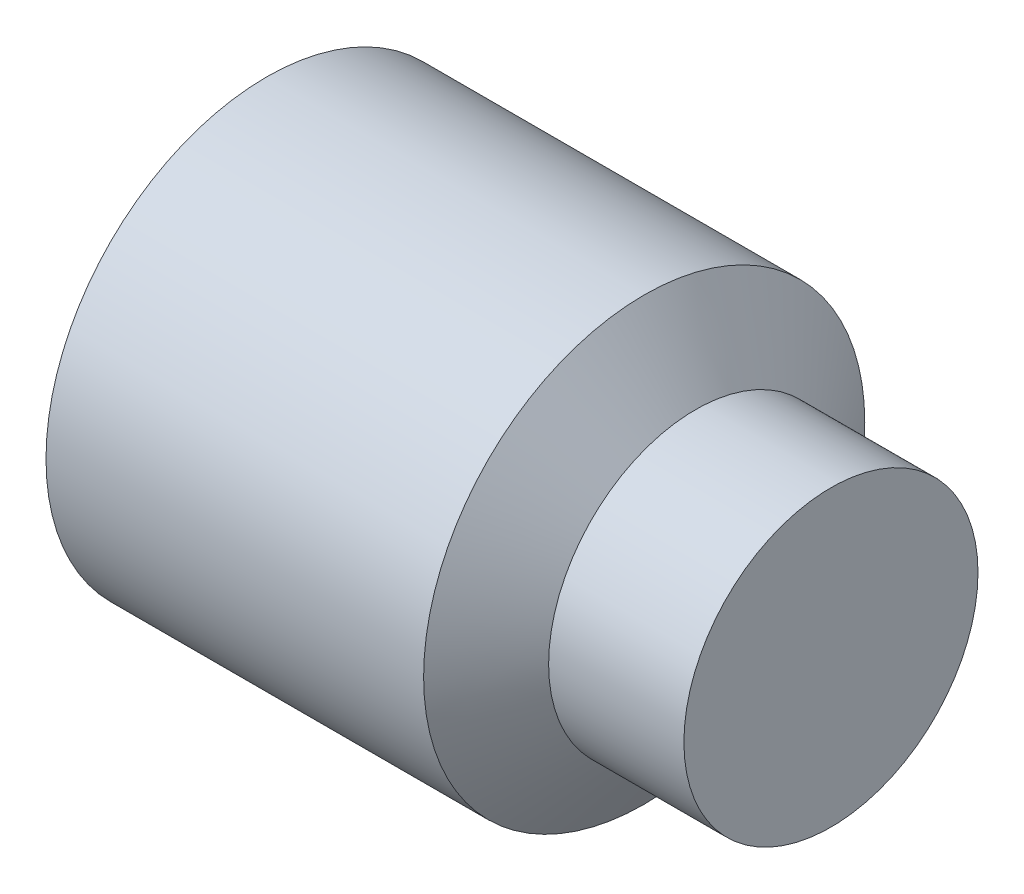
ISO-10303-21;
HEADER;
FILE_DESCRIPTION(('STEP AP214'),'2;1');
FILE_NAME('part.step','',(''),(''),'','','');
FILE_SCHEMA(('AUTOMOTIVE_DESIGN { 1 0 10303 214 1 1 1 1 }'));
ENDSEC;
DATA;
#1=APPLICATION_CONTEXT('core data for automotive mechanical design processes');
#2=APPLICATION_PROTOCOL_DEFINITION('international standard','automotive_design',2000,#1);
#3=PRODUCT_CONTEXT('',#1,'mechanical');
#4=PRODUCT('Part','Part','',(#3));
#5=PRODUCT_RELATED_PRODUCT_CATEGORY('part','',(#4));
#6=PRODUCT_DEFINITION_FORMATION('','',#4);
#7=PRODUCT_DEFINITION_CONTEXT('part definition',#1,'design');
#8=PRODUCT_DEFINITION('design','',#6,#7);
#9=PRODUCT_DEFINITION_SHAPE('','',#8);
#10=(LENGTH_UNIT() NAMED_UNIT(*) SI_UNIT(.MILLI.,.METRE.));
#11=(NAMED_UNIT(*) PLANE_ANGLE_UNIT() SI_UNIT($,.RADIAN.));
#12=(NAMED_UNIT(*) SI_UNIT($,.STERADIAN.) SOLID_ANGLE_UNIT());
#13=UNCERTAINTY_MEASURE_WITH_UNIT(LENGTH_MEASURE(1.E-05),#10,'distance_accuracy_value','');
#14=(GEOMETRIC_REPRESENTATION_CONTEXT(3) GLOBAL_UNCERTAINTY_ASSIGNED_CONTEXT((#13)) GLOBAL_UNIT_ASSIGNED_CONTEXT((#10,
#11,#12)) REPRESENTATION_CONTEXT('',''));
#15=CARTESIAN_POINT('',(0.,0.,0.));
#16=DIRECTION('',(0.,0.,1.));
#17=DIRECTION('',(1.,0.,0.));
#18=AXIS2_PLACEMENT_3D('',#15,#16,#17);
#19=CARTESIAN_POINT('',(0.,0.,0.));
#20=DIRECTION('',(-1.,0.,0.));
#21=DIRECTION('',(0.,0.,1.));
#22=AXIS2_PLACEMENT_3D('',#19,#20,#21);
#23=PLANE('',#22);
#24=CARTESIAN_POINT('',(0.,0.,0.));
#25=DIRECTION('',(-1.,0.,0.));
#26=DIRECTION('',(0.,0.,1.));
#27=AXIS2_PLACEMENT_3D('',#24,#25,#26);
#28=CIRCLE('',#27,1.2195);
#29=CARTESIAN_POINT('',(0.,0.,1.2195));
#30=VERTEX_POINT('',#29);
#31=EDGE_CURVE('E11',#30,#30,#28,.T.);
#32=ORIENTED_EDGE('',*,*,#31,.T.);
#33=EDGE_LOOP('',(#32));
#34=FACE_BOUND('',#33,.T.);
#35=DIRECTION('',(0.,0.,-1.));
#36=VECTOR('',#35,1.);
#37=CARTESIAN_POINT('',(0.,0.750000000000005,0.433012701892219));
#38=LINE('',#37,#36);
#39=CARTESIAN_POINT('',(0.,0.750000000000005,0.433012701892219));
#40=VERTEX_POINT('',#39);
#41=CARTESIAN_POINT('',(0.,0.750000000000005,-0.433012701892219));
#42=VERTEX_POINT('',#41);
#43=EDGE_CURVE('E126',#40,#42,#38,.T.);
#44=ORIENTED_EDGE('',*,*,#43,.F.);
#45=DIRECTION('',(0.,-0.866025403784438,0.5));
#46=VECTOR('',#45,1.);
#47=CARTESIAN_POINT('',(0.,0.750000000000005,0.433012701892219));
#48=LINE('',#47,#46);
#49=CARTESIAN_POINT('',(0.,0.,0.866025403784439));
#50=VERTEX_POINT('',#49);
#51=EDGE_CURVE('E48',#40,#50,#48,.T.);
#52=ORIENTED_EDGE('',*,*,#51,.T.);
#53=DIRECTION('',(0.,0.866025403784439,0.5));
#54=VECTOR('',#53,1.);
#55=CARTESIAN_POINT('',(0.,-0.749999999999994,0.43301270189222));
#56=LINE('',#55,#54);
#57=CARTESIAN_POINT('',(0.,-0.749999999999994,0.43301270189222));
#58=VERTEX_POINT('',#57);
#59=EDGE_CURVE('E117',#58,#50,#56,.T.);
#60=ORIENTED_EDGE('',*,*,#59,.F.);
#61=DIRECTION('',(0.,0.,-1.));
#62=VECTOR('',#61,1.);
#63=CARTESIAN_POINT('',(0.,-0.749999999999994,0.43301270189222));
#64=LINE('',#63,#62);
#65=CARTESIAN_POINT('',(0.,-0.749999999999994,-0.433012701892218));
#66=VERTEX_POINT('',#65);
#67=EDGE_CURVE('E120',#58,#66,#64,.T.);
#68=ORIENTED_EDGE('',*,*,#67,.T.);
#69=DIRECTION('',(0.,0.866025403784438,-0.500000000000001));
#70=VECTOR('',#69,1.);
#71=CARTESIAN_POINT('',(0.,-0.749999999999994,-0.433012701892218));
#72=LINE('',#71,#70);
#73=CARTESIAN_POINT('',(0.,0.,-0.866025403784438));
#74=VERTEX_POINT('',#73);
#75=EDGE_CURVE('E123',#66,#74,#72,.T.);
#76=ORIENTED_EDGE('',*,*,#75,.T.);
#77=DIRECTION('',(0.,-0.866025403784439,-0.5));
#78=VECTOR('',#77,1.);
#79=CARTESIAN_POINT('',(0.,0.750000000000005,-0.433012701892219));
#80=LINE('',#79,#78);
#81=EDGE_CURVE('E106',#42,#74,#80,.T.);
#82=ORIENTED_EDGE('',*,*,#81,.F.);
#83=EDGE_LOOP('',(#44,#52,#60,#68,#76,#82));
#84=FACE_BOUND('',#83,.T.);
#85=ADVANCED_FACE('F34',(#34,#84),#23,.T.);
#86=CARTESIAN_POINT('',(0.,0.,0.));
#87=DIRECTION('',(1.,0.,0.));
#88=DIRECTION('',(0.,0.,-1.));
#89=AXIS2_PLACEMENT_3D('',#86,#87,#88);
#90=CONICAL_SURFACE('',#89,1.2195,1.0471975511966);
#91=CARTESIAN_POINT('',(0.161946750507689,0.,0.));
#92=DIRECTION('',(-1.,0.,0.));
#93=DIRECTION('',(0.,0.,1.));
#94=AXIS2_PLACEMENT_3D('',#91,#92,#93);
#95=CIRCLE('',#94,1.5);
#96=CARTESIAN_POINT('',(0.161946750507689,0.,1.5));
#97=VERTEX_POINT('',#96);
#98=EDGE_CURVE('E41',#97,#97,#95,.T.);
#99=ORIENTED_EDGE('',*,*,#98,.T.);
#100=EDGE_LOOP('',(#99));
#101=FACE_BOUND('',#100,.T.);
#102=ORIENTED_EDGE('',*,*,#31,.F.);
#103=EDGE_LOOP('',(#102));
#104=FACE_BOUND('',#103,.T.);
#105=ADVANCED_FACE('F146',(#101,#104),#90,.T.);
#106=CARTESIAN_POINT('',(-12.7,0.,0.));
#107=DIRECTION('',(-1.,0.,0.));
#108=DIRECTION('',(0.,0.,1.));
#109=AXIS2_PLACEMENT_3D('',#106,#107,#108);
#110=CYLINDRICAL_SURFACE('',#109,1.5);
#111=CARTESIAN_POINT('',(2.72989623089515,0.,0.));
#112=DIRECTION('',(-1.,0.,0.));
#113=DIRECTION('',(0.,0.,1.));
#114=AXIS2_PLACEMENT_3D('',#111,#112,#113);
#115=CIRCLE('',#114,1.5);
#116=CARTESIAN_POINT('',(2.72989623089515,0.,1.5));
#117=VERTEX_POINT('',#116);
#118=EDGE_CURVE('E141',#117,#117,#115,.T.);
#119=ORIENTED_EDGE('',*,*,#118,.T.);
#120=EDGE_LOOP('',(#119));
#121=FACE_BOUND('',#120,.T.);
#122=ORIENTED_EDGE('',*,*,#98,.F.);
#123=EDGE_LOOP('',(#122));
#124=FACE_BOUND('',#123,.T.);
#125=ADVANCED_FACE('F149',(#121,#124),#110,.T.);
#126=CARTESIAN_POINT('',(2.72989623089515,0.,0.));
#127=DIRECTION('',(-1.,0.,0.));
#128=DIRECTION('',(0.,0.,1.));
#129=AXIS2_PLACEMENT_3D('',#126,#127,#128);
#130=CONICAL_SURFACE('',#129,1.5,0.959931088596885);
#131=CARTESIAN_POINT('',(3.08,0.,0.));
#132=DIRECTION('',(-1.,0.,0.));
#133=DIRECTION('',(0.,0.,1.));
#134=AXIS2_PLACEMENT_3D('',#131,#132,#133);
#135=CIRCLE('',#134,1.);
#136=CARTESIAN_POINT('',(3.08,0.,1.));
#137=VERTEX_POINT('',#136);
#138=EDGE_CURVE('E138',#137,#137,#135,.T.);
#139=ORIENTED_EDGE('',*,*,#138,.T.);
#140=EDGE_LOOP('',(#139));
#141=FACE_BOUND('',#140,.T.);
#142=ORIENTED_EDGE('',*,*,#118,.F.);
#143=EDGE_LOOP('',(#142));
#144=FACE_BOUND('',#143,.T.);
#145=ADVANCED_FACE('F151',(#141,#144),#130,.T.);
#146=CARTESIAN_POINT('',(-12.7,0.,0.));
#147=DIRECTION('',(-1.,0.,0.));
#148=DIRECTION('',(0.,0.,1.));
#149=AXIS2_PLACEMENT_3D('',#146,#147,#148);
#150=CYLINDRICAL_SURFACE('',#149,1.);
#151=CARTESIAN_POINT('',(4.,0.,0.));
#152=DIRECTION('',(-1.,0.,0.));
#153=DIRECTION('',(0.,0.,1.));
#154=AXIS2_PLACEMENT_3D('',#151,#152,#153);
#155=CIRCLE('',#154,1.);
#156=CARTESIAN_POINT('',(4.,0.,1.));
#157=VERTEX_POINT('',#156);
#158=EDGE_CURVE('E135',#157,#157,#155,.T.);
#159=ORIENTED_EDGE('',*,*,#158,.T.);
#160=EDGE_LOOP('',(#159));
#161=FACE_BOUND('',#160,.T.);
#162=ORIENTED_EDGE('',*,*,#138,.F.);
#163=EDGE_LOOP('',(#162));
#164=FACE_BOUND('',#163,.T.);
#165=ADVANCED_FACE('F158',(#161,#164),#150,.T.);
#166=CARTESIAN_POINT('',(4.,1.,0.));
#167=DIRECTION('',(1.,0.,0.));
#168=DIRECTION('',(0.,0.,-1.));
#169=AXIS2_PLACEMENT_3D('',#166,#167,#168);
#170=PLANE('',#169);
#171=ORIENTED_EDGE('',*,*,#158,.F.);
#172=EDGE_LOOP('',(#171));
#173=FACE_BOUND('',#172,.T.);
#174=ADVANCED_FACE('F193',(#173),#170,.T.);
#175=CARTESIAN_POINT('',(2.,0.750000000000005,0.433012701892219));
#176=DIRECTION('',(0.,-0.5,-0.866025403784438));
#177=DIRECTION('',(0.,0.866025403784438,-0.5));
#178=AXIS2_PLACEMENT_3D('',#175,#176,#177);
#179=PLANE('',#178);
#180=ORIENTED_EDGE('',*,*,#51,.F.);
#181=DIRECTION('',(-1.,0.,0.));
#182=VECTOR('',#181,1.);
#183=CARTESIAN_POINT('',(2.,0.750000000000005,0.433012701892219));
#184=LINE('',#183,#182);
#185=CARTESIAN_POINT('',(2.,0.750000000000005,0.433012701892219));
#186=VERTEX_POINT('',#185);
#187=EDGE_CURVE('E53',#186,#40,#184,.T.);
#188=ORIENTED_EDGE('',*,*,#187,.F.);
#189=DIRECTION('',(0.,-0.866025403784438,0.5));
#190=VECTOR('',#189,1.);
#191=CARTESIAN_POINT('',(2.,0.750000000000005,0.433012701892219));
#192=LINE('',#191,#190);
#193=CARTESIAN_POINT('',(2.,0.,0.866025403784439));
#194=VERTEX_POINT('',#193);
#195=EDGE_CURVE('E80',#186,#194,#192,.T.);
#196=ORIENTED_EDGE('',*,*,#195,.T.);
#197=DIRECTION('',(-1.,0.,0.));
#198=VECTOR('',#197,1.);
#199=CARTESIAN_POINT('',(2.,0.,0.866025403784439));
#200=LINE('',#199,#198);
#201=EDGE_CURVE('E133',#194,#50,#200,.T.);
#202=ORIENTED_EDGE('',*,*,#201,.T.);
#203=EDGE_LOOP('',(#180,#188,#196,#202));
#204=FACE_BOUND('',#203,.T.);
#205=ADVANCED_FACE('F189',(#204),#179,.T.);
#206=CARTESIAN_POINT('',(2.,-0.749999999999994,0.43301270189222));
#207=DIRECTION('',(0.,-0.5,0.866025403784439));
#208=DIRECTION('',(0.,-0.866025403784439,-0.5));
#209=AXIS2_PLACEMENT_3D('',#206,#207,#208);
#210=PLANE('',#209);
#211=ORIENTED_EDGE('',*,*,#59,.T.);
#212=ORIENTED_EDGE('',*,*,#201,.F.);
#213=DIRECTION('',(0.,0.866025403784439,0.5));
#214=VECTOR('',#213,1.);
#215=CARTESIAN_POINT('',(2.,-0.749999999999994,0.43301270189222));
#216=LINE('',#215,#214);
#217=CARTESIAN_POINT('',(2.,-0.749999999999994,0.43301270189222));
#218=VERTEX_POINT('',#217);
#219=EDGE_CURVE('E283',#218,#194,#216,.T.);
#220=ORIENTED_EDGE('',*,*,#219,.F.);
#221=DIRECTION('',(-1.,0.,0.));
#222=VECTOR('',#221,1.);
#223=CARTESIAN_POINT('',(2.,-0.749999999999994,0.43301270189222));
#224=LINE('',#223,#222);
#225=EDGE_CURVE('E131',#218,#58,#224,.T.);
#226=ORIENTED_EDGE('',*,*,#225,.T.);
#227=EDGE_LOOP('',(#211,#212,#220,#226));
#228=FACE_BOUND('',#227,.T.);
#229=ADVANCED_FACE('F185',(#228),#210,.F.);
#230=CARTESIAN_POINT('',(2.,-0.749999999999994,0.43301270189222));
#231=DIRECTION('',(0.,1.,0.));
#232=DIRECTION('',(0.,0.,1.));
#233=AXIS2_PLACEMENT_3D('',#230,#231,#232);
#234=PLANE('',#233);
#235=ORIENTED_EDGE('',*,*,#67,.F.);
#236=ORIENTED_EDGE('',*,*,#225,.F.);
#237=DIRECTION('',(0.,0.,-1.));
#238=VECTOR('',#237,1.);
#239=CARTESIAN_POINT('',(2.,-0.749999999999994,0.43301270189222));
#240=LINE('',#239,#238);
#241=CARTESIAN_POINT('',(2.,-0.749999999999994,-0.433012701892218));
#242=VERTEX_POINT('',#241);
#243=EDGE_CURVE('E101',#218,#242,#240,.T.);
#244=ORIENTED_EDGE('',*,*,#243,.T.);
#245=DIRECTION('',(-1.,0.,0.));
#246=VECTOR('',#245,1.);
#247=CARTESIAN_POINT('',(2.,-0.749999999999994,-0.433012701892218));
#248=LINE('',#247,#246);
#249=EDGE_CURVE('E96',#242,#66,#248,.T.);
#250=ORIENTED_EDGE('',*,*,#249,.T.);
#251=EDGE_LOOP('',(#235,#236,#244,#250));
#252=FACE_BOUND('',#251,.T.);
#253=ADVANCED_FACE('F182',(#252),#234,.T.);
#254=CARTESIAN_POINT('',(2.,-0.749999999999994,-0.433012701892218));
#255=DIRECTION('',(0.,0.500000000000001,0.866025403784438));
#256=DIRECTION('',(0.,-0.866025403784438,0.500000000000001));
#257=AXIS2_PLACEMENT_3D('',#254,#255,#256);
#258=PLANE('',#257);
#259=ORIENTED_EDGE('',*,*,#75,.F.);
#260=ORIENTED_EDGE('',*,*,#249,.F.);
#261=DIRECTION('',(0.,0.866025403784438,-0.500000000000001));
#262=VECTOR('',#261,1.);
#263=CARTESIAN_POINT('',(2.,-0.749999999999994,-0.433012701892218));
#264=LINE('',#263,#262);
#265=CARTESIAN_POINT('',(2.,0.,-0.866025403784438));
#266=VERTEX_POINT('',#265);
#267=EDGE_CURVE('E91',#242,#266,#264,.T.);
#268=ORIENTED_EDGE('',*,*,#267,.T.);
#269=DIRECTION('',(-1.,0.,0.));
#270=VECTOR('',#269,1.);
#271=CARTESIAN_POINT('',(2.,0.,-0.866025403784438));
#272=LINE('',#271,#270);
#273=EDGE_CURVE('E95',#266,#74,#272,.T.);
#274=ORIENTED_EDGE('',*,*,#273,.T.);
#275=EDGE_LOOP('',(#259,#260,#268,#274));
#276=FACE_BOUND('',#275,.T.);
#277=ADVANCED_FACE('F94',(#276),#258,.T.);
#278=CARTESIAN_POINT('',(2.,0.750000000000005,-0.433012701892219));
#279=DIRECTION('',(0.,0.5,-0.866025403784439));
#280=DIRECTION('',(0.,0.866025403784439,0.5));
#281=AXIS2_PLACEMENT_3D('',#278,#279,#280);
#282=PLANE('',#281);
#283=ORIENTED_EDGE('',*,*,#81,.T.);
#284=ORIENTED_EDGE('',*,*,#273,.F.);
#285=DIRECTION('',(0.,-0.866025403784439,-0.5));
#286=VECTOR('',#285,1.);
#287=CARTESIAN_POINT('',(2.,0.750000000000005,-0.433012701892219));
#288=LINE('',#287,#286);
#289=CARTESIAN_POINT('',(2.,0.750000000000005,-0.433012701892219));
#290=VERTEX_POINT('',#289);
#291=EDGE_CURVE('E100',#290,#266,#288,.T.);
#292=ORIENTED_EDGE('',*,*,#291,.F.);
#293=DIRECTION('',(-1.,0.,0.));
#294=VECTOR('',#293,1.);
#295=CARTESIAN_POINT('',(2.,0.750000000000005,-0.433012701892219));
#296=LINE('',#295,#294);
#297=EDGE_CURVE('E76',#290,#42,#296,.T.);
#298=ORIENTED_EDGE('',*,*,#297,.T.);
#299=EDGE_LOOP('',(#283,#284,#292,#298));
#300=FACE_BOUND('',#299,.T.);
#301=ADVANCED_FACE('F103',(#300),#282,.F.);
#302=CARTESIAN_POINT('',(2.,0.750000000000005,0.433012701892219));
#303=DIRECTION('',(0.,1.,0.));
#304=DIRECTION('',(0.,0.,1.));
#305=AXIS2_PLACEMENT_3D('',#302,#303,#304);
#306=PLANE('',#305);
#307=ORIENTED_EDGE('',*,*,#43,.T.);
#308=ORIENTED_EDGE('',*,*,#297,.F.);
#309=DIRECTION('',(0.,0.,-1.));
#310=VECTOR('',#309,1.);
#311=CARTESIAN_POINT('',(2.,0.750000000000005,0.433012701892219));
#312=LINE('',#311,#310);
#313=EDGE_CURVE('E111',#186,#290,#312,.T.);
#314=ORIENTED_EDGE('',*,*,#313,.F.);
#315=ORIENTED_EDGE('',*,*,#187,.T.);
#316=EDGE_LOOP('',(#307,#308,#314,#315));
#317=FACE_BOUND('',#316,.T.);
#318=ADVANCED_FACE('F170',(#317),#306,.F.);
#319=CARTESIAN_POINT('',(2.,1.5,0.));
#320=DIRECTION('',(1.,0.,0.));
#321=DIRECTION('',(0.,0.,-1.));
#322=AXIS2_PLACEMENT_3D('',#319,#320,#321);
#323=PLANE('',#322);
#324=ORIENTED_EDGE('',*,*,#195,.F.);
#325=ORIENTED_EDGE('',*,*,#313,.T.);
#326=ORIENTED_EDGE('',*,*,#291,.T.);
#327=ORIENTED_EDGE('',*,*,#267,.F.);
#328=ORIENTED_EDGE('',*,*,#243,.F.);
#329=ORIENTED_EDGE('',*,*,#219,.T.);
#330=EDGE_LOOP('',(#324,#325,#326,#327,#328,#329));
#331=FACE_BOUND('',#330,.T.);
#332=ADVANCED_FACE('F109',(#331),#323,.F.);
#333=CLOSED_SHELL('',(#85,#105,#125,#145,#165,#174,#205,#229,#253,#277,#301,#318,#332));
#334=MANIFOLD_SOLID_BREP('B2',#333);
#335=ADVANCED_BREP_SHAPE_REPRESENTATION('',(#18,#334),#14);
#336=SHAPE_DEFINITION_REPRESENTATION(#9,#335);
ENDSEC;
END-ISO-10303-21;
